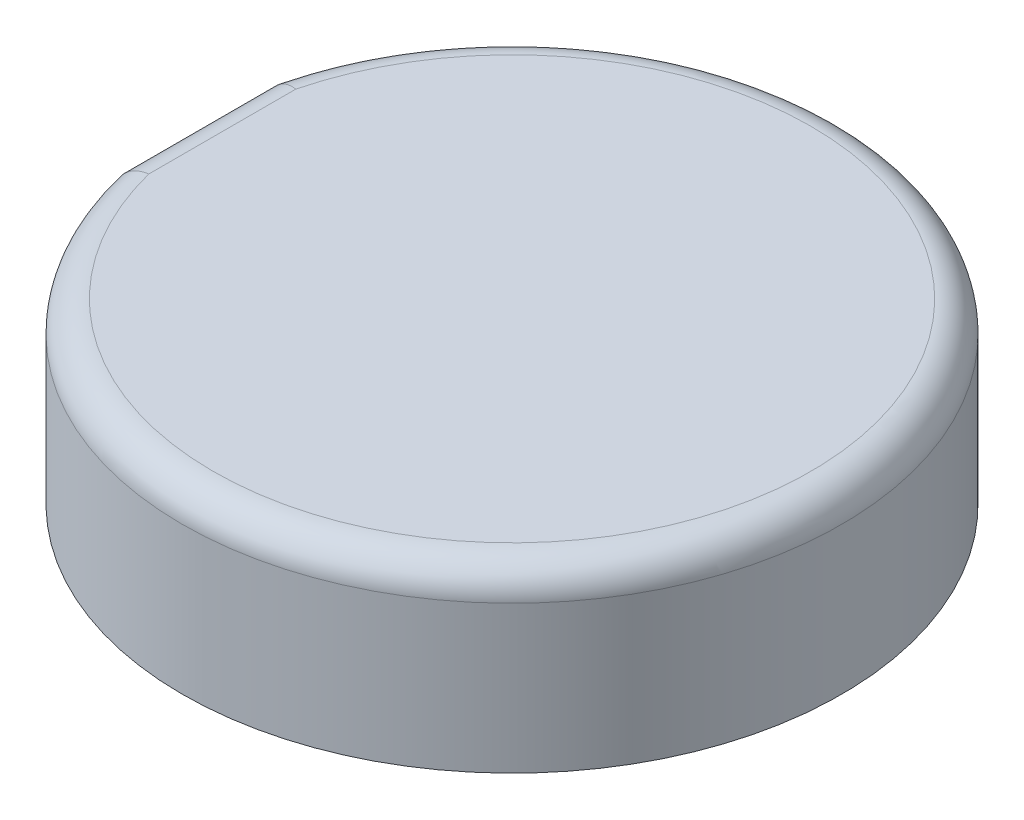
ISO-10303-21;
HEADER;
FILE_DESCRIPTION(('STEP AP214'),'2;1');
FILE_NAME('part.step','',(''),(''),'','','');
FILE_SCHEMA(('AUTOMOTIVE_DESIGN { 1 0 10303 214 1 1 1 1 }'));
ENDSEC;
DATA;
#1=APPLICATION_CONTEXT('core data for automotive mechanical design processes');
#2=APPLICATION_PROTOCOL_DEFINITION('international standard','automotive_design',2000,#1);
#3=PRODUCT_CONTEXT('',#1,'mechanical');
#4=PRODUCT('Part','Part','',(#3));
#5=PRODUCT_RELATED_PRODUCT_CATEGORY('part','',(#4));
#6=PRODUCT_DEFINITION_FORMATION('','',#4);
#7=PRODUCT_DEFINITION_CONTEXT('part definition',#1,'design');
#8=PRODUCT_DEFINITION('design','',#6,#7);
#9=PRODUCT_DEFINITION_SHAPE('','',#8);
#10=(LENGTH_UNIT() NAMED_UNIT(*) SI_UNIT(.MILLI.,.METRE.));
#11=(NAMED_UNIT(*) PLANE_ANGLE_UNIT() SI_UNIT($,.RADIAN.));
#12=(NAMED_UNIT(*) SI_UNIT($,.STERADIAN.) SOLID_ANGLE_UNIT());
#13=UNCERTAINTY_MEASURE_WITH_UNIT(LENGTH_MEASURE(1.E-05),#10,'distance_accuracy_value','');
#14=(GEOMETRIC_REPRESENTATION_CONTEXT(3) GLOBAL_UNCERTAINTY_ASSIGNED_CONTEXT((#13)) GLOBAL_UNIT_ASSIGNED_CONTEXT((#10,
#11,#12)) REPRESENTATION_CONTEXT('',''));
#15=CARTESIAN_POINT('',(0.,0.,0.));
#16=DIRECTION('',(0.,0.,1.));
#17=DIRECTION('',(1.,0.,0.));
#18=AXIS2_PLACEMENT_3D('',#15,#16,#17);
#19=CARTESIAN_POINT('',(0.,5.8,0.));
#20=DIRECTION('',(0.,-1.,0.));
#21=DIRECTION('',(0.,0.,-1.));
#22=AXIS2_PLACEMENT_3D('',#19,#20,#21);
#23=CYLINDRICAL_SURFACE('',#22,10.75);
#24=DIRECTION('',(0.,-1.,0.));
#25=VECTOR('',#24,1.);
#26=CARTESIAN_POINT('',(-10.45,5.8,-2.52190404258371));
#27=LINE('',#26,#25);
#28=CARTESIAN_POINT('',(-10.45,4.8,-2.52190404258371));
#29=VERTEX_POINT('',#28);
#30=CARTESIAN_POINT('',(-10.45,0.,-2.52190404258371));
#31=VERTEX_POINT('',#30);
#32=EDGE_CURVE('E85',#29,#31,#27,.T.);
#33=ORIENTED_EDGE('',*,*,#32,.F.);
#34=CARTESIAN_POINT('',(0.,4.8,0.));
#35=DIRECTION('',(0.,1.,0.));
#36=DIRECTION('',(0.,0.,1.));
#37=AXIS2_PLACEMENT_3D('',#34,#35,#36);
#38=CIRCLE('',#37,10.75);
#39=CARTESIAN_POINT('',(-10.45,4.8,2.52190404258371));
#40=VERTEX_POINT('',#39);
#41=EDGE_CURVE('E11',#29,#40,#38,.F.);
#42=ORIENTED_EDGE('',*,*,#41,.T.);
#43=DIRECTION('',(0.,-1.,0.));
#44=VECTOR('',#43,1.);
#45=CARTESIAN_POINT('',(-10.45,5.8,2.52190404258371));
#46=LINE('',#45,#44);
#47=CARTESIAN_POINT('',(-10.45,0.,2.52190404258371));
#48=VERTEX_POINT('',#47);
#49=EDGE_CURVE('E93',#40,#48,#46,.T.);
#50=ORIENTED_EDGE('',*,*,#49,.T.);
#51=CARTESIAN_POINT('',(0.,0.,0.));
#52=DIRECTION('',(0.,1.,0.));
#53=DIRECTION('',(0.,0.,1.));
#54=AXIS2_PLACEMENT_3D('',#51,#52,#53);
#55=CIRCLE('',#54,10.75);
#56=EDGE_CURVE('E97',#48,#31,#55,.T.);
#57=ORIENTED_EDGE('',*,*,#56,.T.);
#58=EDGE_LOOP('',(#33,#42,#50,#57));
#59=FACE_BOUND('',#58,.T.);
#60=ADVANCED_FACE('F43',(#59),#23,.T.);
#61=CARTESIAN_POINT('',(-10.45,5.8,2.52190404258371));
#62=DIRECTION('',(1.,0.,0.));
#63=DIRECTION('',(0.,0.,-1.));
#64=AXIS2_PLACEMENT_3D('',#61,#62,#63);
#65=PLANE('',#64);
#66=ORIENTED_EDGE('',*,*,#49,.F.);
#67=DIRECTION('',(0.,0.,1.));
#68=VECTOR('',#67,1.);
#69=CARTESIAN_POINT('',(-10.45,4.8,-2.52190404258371));
#70=LINE('',#69,#68);
#71=EDGE_CURVE('E58',#40,#29,#70,.F.);
#72=ORIENTED_EDGE('',*,*,#71,.T.);
#73=ORIENTED_EDGE('',*,*,#32,.T.);
#74=DIRECTION('',(0.,0.,1.));
#75=VECTOR('',#74,1.);
#76=CARTESIAN_POINT('',(-10.45,0.,2.52190404258371));
#77=LINE('',#76,#75);
#78=EDGE_CURVE('E88',#31,#48,#77,.T.);
#79=ORIENTED_EDGE('',*,*,#78,.T.);
#80=EDGE_LOOP('',(#66,#72,#73,#79));
#81=FACE_BOUND('',#80,.T.);
#82=ADVANCED_FACE('F87',(#81),#65,.F.);
#83=CARTESIAN_POINT('',(0.,5.8,0.));
#84=DIRECTION('',(0.,1.,0.));
#85=DIRECTION('',(0.,0.,1.));
#86=AXIS2_PLACEMENT_3D('',#83,#84,#85);
#87=PLANE('',#86);
#88=CARTESIAN_POINT('',(0.,5.8,0.));
#89=DIRECTION('',(0.,1.,0.));
#90=DIRECTION('',(0.,0.,1.));
#91=AXIS2_PLACEMENT_3D('',#88,#89,#90);
#92=CIRCLE('',#91,9.75);
#93=CARTESIAN_POINT('',(-9.44999999999986,5.8,2.40000000000054));
#94=VERTEX_POINT('',#93);
#95=CARTESIAN_POINT('',(-9.44999999999986,5.8,-2.40000000000054));
#96=VERTEX_POINT('',#95);
#97=EDGE_CURVE('E92',#94,#96,#92,.T.);
#98=ORIENTED_EDGE('',*,*,#97,.T.);
#99=DIRECTION('',(0.,0.,1.));
#100=VECTOR('',#99,1.);
#101=CARTESIAN_POINT('',(-9.45,5.8,2.52190404258371));
#102=LINE('',#101,#100);
#103=EDGE_CURVE('E109',#96,#94,#102,.T.);
#104=ORIENTED_EDGE('',*,*,#103,.T.);
#105=EDGE_LOOP('',(#98,#104));
#106=FACE_BOUND('',#105,.T.);
#107=ADVANCED_FACE('F128',(#106),#87,.T.);
#108=CARTESIAN_POINT('',(0.,0.,0.));
#109=DIRECTION('',(0.,1.,0.));
#110=DIRECTION('',(0.,0.,1.));
#111=AXIS2_PLACEMENT_3D('',#108,#109,#110);
#112=PLANE('',#111);
#113=ORIENTED_EDGE('',*,*,#56,.F.);
#114=ORIENTED_EDGE('',*,*,#78,.F.);
#115=EDGE_LOOP('',(#113,#114));
#116=FACE_BOUND('',#115,.T.);
#117=ADVANCED_FACE('F96',(#116),#112,.F.);
#118=CARTESIAN_POINT('',(0.,4.8,0.));
#119=DIRECTION('',(0.,1.,0.));
#120=DIRECTION('',(0.,0.,1.));
#121=AXIS2_PLACEMENT_3D('',#118,#119,#120);
#122=TOROIDAL_SURFACE('',#121,9.75,1.);
#123=CARTESIAN_POINT('',(-10.45,4.8,2.52190404258371));
#124=CARTESIAN_POINT('',(-10.4499999170774,4.82798873339094,2.52190399499427));
#125=CARTESIAN_POINT('',(-10.4488241997319,4.85596400949114,2.52176417618998));
#126=CARTESIAN_POINT('',(-10.4441344824881,4.91171333206155,2.52120622018278));
#127=CARTESIAN_POINT('',(-10.4406206257998,4.93948739075092,2.5207881000257));
#128=CARTESIAN_POINT('',(-10.4266077028798,5.02215354952764,2.51912007308609));
#129=CARTESIAN_POINT('',(-10.4126371772075,5.07649017697752,2.51745648929566));
#130=CARTESIAN_POINT('',(-10.3758429075908,5.18202555821809,2.51306794675598));
#131=CARTESIAN_POINT('',(-10.3530155305359,5.23322301431678,2.51034255244657));
#132=CARTESIAN_POINT('',(-10.2991794725499,5.33104493180231,2.50390056140186));
#133=CARTESIAN_POINT('',(-10.2681722618759,5.37767021293571,2.50018414279362));
#134=CARTESIAN_POINT('',(-10.1987718314555,5.46518385754219,2.49184279141549));
#135=CARTESIAN_POINT('',(-10.1603571001321,5.50605489745233,2.48721521177062));
#136=CARTESIAN_POINT('',(-10.0772909706042,5.58078660009335,2.47717575639934));
#137=CARTESIAN_POINT('',(-10.0326374918285,5.61464491474824,2.47176361900663));
#138=CARTESIAN_POINT('',(-9.93805202812465,5.67462241829296,2.46025700394653));
#139=CARTESIAN_POINT('',(-9.88808571452822,5.70068653725673,2.45415807151147));
#140=CARTESIAN_POINT('',(-9.78456128532681,5.74404016903951,2.44147022320747));
#141=CARTESIAN_POINT('',(-9.73100584233141,5.76133613056132,2.43488167153919));
#142=CARTESIAN_POINT('',(-9.64136760641692,5.78218100774131,2.42380681360068));
#143=CARTESIAN_POINT('',(-9.6058755457942,5.78843345926851,2.4194100709979));
#144=CARTESIAN_POINT('',(-9.53447045316534,5.79707247426921,2.41053974230263));
#145=CARTESIAN_POINT('',(-9.498558191335,5.79946524858216,2.40606629139514));
#146=CARTESIAN_POINT('',(-9.45843260792476,5.79997339407678,2.40105390330662));
#147=CARTESIAN_POINT('',(-9.4542160858936,5.80000007005447,2.40052701185893));
#148=CARTESIAN_POINT('',(-9.45,5.8,2.4));
#149=B_SPLINE_CURVE_WITH_KNOTS('',3,(#123,#124,#125,#126,#127,#128,#129,#130,#131,#132,#133,
#134,#135,#136,#137,#138,#139,#140,#141,#142,#143,#144,#145,#146,#147,#148),.UNSPECIFIED.,.F.,
.F.,(4,2,2,2,2,2,2,2,2,2,2,2,4),(0.,0.0839144613912285,0.167823783531218,0.335344645099898,
0.50293429706725,0.670493846689154,0.838547526949997,1.0066573861061,1.17592839066303,
1.34507472047186,1.45381235438992,1.56237483683533,1.57512263668112),.UNSPECIFIED.);
#150=EDGE_CURVE('E103',#40,#94,#149,.T.);
#151=ORIENTED_EDGE('',*,*,#150,.F.);
#152=ORIENTED_EDGE('',*,*,#41,.F.);
#153=CARTESIAN_POINT('',(-10.45,4.8,-2.52190404258371));
#154=CARTESIAN_POINT('',(-10.4499999170774,4.82798873339094,-2.52190399499427));
#155=CARTESIAN_POINT('',(-10.4488241997319,4.85596400949114,-2.52176417618998));
#156=CARTESIAN_POINT('',(-10.4441344824881,4.91171333206155,-2.52120622018278));
#157=CARTESIAN_POINT('',(-10.4406206257998,4.93948739075092,-2.52078810002569));
#158=CARTESIAN_POINT('',(-10.4266077028798,5.02215354952764,-2.51912007308608));
#159=CARTESIAN_POINT('',(-10.4126371772075,5.07649017697752,-2.51745648929566));
#160=CARTESIAN_POINT('',(-10.3758429075908,5.18202555821809,-2.51306794675599));
#161=CARTESIAN_POINT('',(-10.3530155305359,5.23322301431678,-2.51034255244658));
#162=CARTESIAN_POINT('',(-10.2991794725499,5.33104493180231,-2.50390056140186));
#163=CARTESIAN_POINT('',(-10.2681722618759,5.37767021293571,-2.50018414279362));
#164=CARTESIAN_POINT('',(-10.1987718314555,5.46518385754218,-2.49184279141549));
#165=CARTESIAN_POINT('',(-10.1603571001321,5.50605489745233,-2.48721521177062));
#166=CARTESIAN_POINT('',(-10.0772909706042,5.58078660009335,-2.47717575639933));
#167=CARTESIAN_POINT('',(-10.0326374918285,5.61464491474824,-2.47176361900663));
#168=CARTESIAN_POINT('',(-9.93805202812465,5.67462241829296,-2.46025700394654));
#169=CARTESIAN_POINT('',(-9.88808571452822,5.70068653725673,-2.45415807151148));
#170=CARTESIAN_POINT('',(-9.78456128532681,5.74404016903951,-2.44147022320747));
#171=CARTESIAN_POINT('',(-9.73100584233141,5.76133613056132,-2.43488167153919));
#172=CARTESIAN_POINT('',(-9.64136760641692,5.78218100774131,-2.42380681360067));
#173=CARTESIAN_POINT('',(-9.60587554579421,5.78843345926851,-2.41941007099789));
#174=CARTESIAN_POINT('',(-9.53447045316533,5.79707247426921,-2.41053974230264));
#175=CARTESIAN_POINT('',(-9.498558191335,5.79946524858216,-2.40606629139519));
#176=CARTESIAN_POINT('',(-9.45843260792475,5.79997339407678,-2.40105390330663));
#177=CARTESIAN_POINT('',(-9.45421608589359,5.80000007005447,-2.40052701185893));
#178=CARTESIAN_POINT('',(-9.45,5.8,-2.4));
#179=B_SPLINE_CURVE_WITH_KNOTS('',3,(#153,#154,#155,#156,#157,#158,#159,#160,#161,#162,#163,
#164,#165,#166,#167,#168,#169,#170,#171,#172,#173,#174,#175,#176,#177,#178),.UNSPECIFIED.,.F.,
.F.,(4,2,2,2,2,2,2,2,2,2,2,2,4),(0.,0.0839144613912285,0.167823783531218,0.335344645099898,
0.502934297067249,0.670493846689153,0.838547526949996,1.0066573861061,1.17592839066303,
1.34507472047186,1.45381235438992,1.56237483683532,1.57512263668112),.UNSPECIFIED.);
#180=EDGE_CURVE('E48',#96,#29,#179,.F.);
#181=ORIENTED_EDGE('',*,*,#180,.F.);
#182=ORIENTED_EDGE('',*,*,#97,.F.);
#183=EDGE_LOOP('',(#151,#152,#181,#182));
#184=FACE_BOUND('',#183,.T.);
#185=ADVANCED_FACE('F45',(#184),#122,.T.);
#186=CARTESIAN_POINT('',(-9.45,4.8,0.));
#187=DIRECTION('',(0.,0.,-1.));
#188=DIRECTION('',(-1.,0.,0.));
#189=AXIS2_PLACEMENT_3D('',#186,#187,#188);
#190=CYLINDRICAL_SURFACE('',#189,1.);
#191=ORIENTED_EDGE('',*,*,#180,.T.);
#192=ORIENTED_EDGE('',*,*,#71,.F.);
#193=ORIENTED_EDGE('',*,*,#150,.T.);
#194=ORIENTED_EDGE('',*,*,#103,.F.);
#195=EDGE_LOOP('',(#191,#192,#193,#194));
#196=FACE_BOUND('',#195,.T.);
#197=ADVANCED_FACE('F119',(#196),#190,.T.);
#198=CLOSED_SHELL('',(#60,#82,#107,#117,#185,#197));
#199=MANIFOLD_SOLID_BREP('B2',#198);
#200=ADVANCED_BREP_SHAPE_REPRESENTATION('',(#18,#199),#14);
#201=SHAPE_DEFINITION_REPRESENTATION(#9,#200);
ENDSEC;
END-ISO-10303-21;
